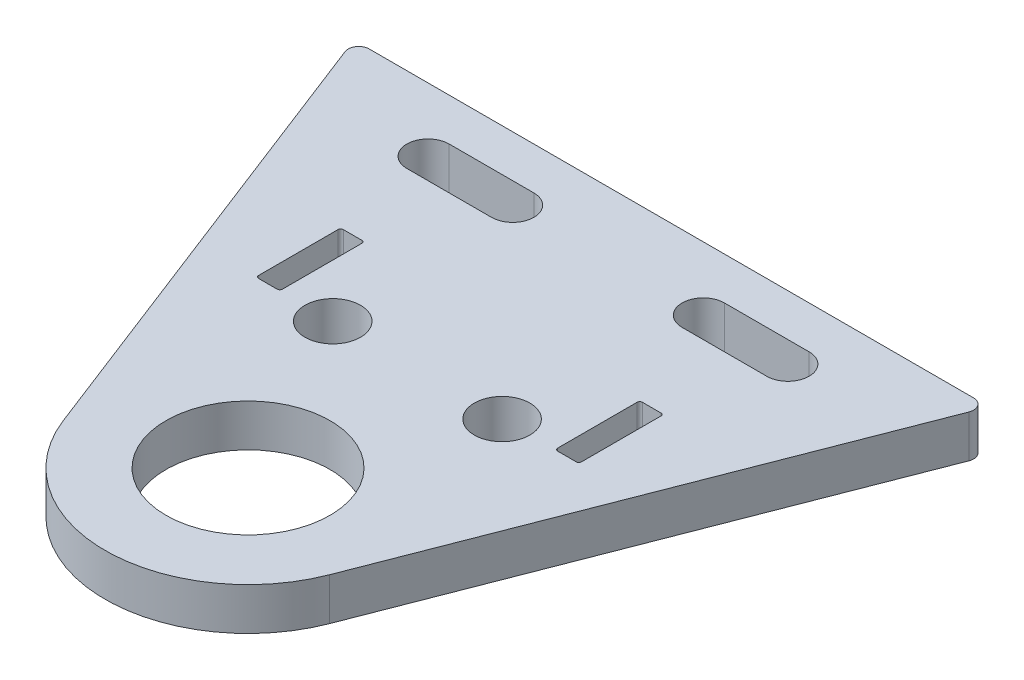
ISO-10303-21;
HEADER;
FILE_DESCRIPTION(('STEP AP214'),'2;1');
FILE_NAME('part.step','',(''),(''),'','','');
FILE_SCHEMA(('AUTOMOTIVE_DESIGN { 1 0 10303 214 1 1 1 1 }'));
ENDSEC;
DATA;
#1=APPLICATION_CONTEXT('core data for automotive mechanical design processes');
#2=APPLICATION_PROTOCOL_DEFINITION('international standard','automotive_design',2000,#1);
#3=PRODUCT_CONTEXT('',#1,'mechanical');
#4=PRODUCT('Part','Part','',(#3));
#5=PRODUCT_RELATED_PRODUCT_CATEGORY('part','',(#4));
#6=PRODUCT_DEFINITION_FORMATION('','',#4);
#7=PRODUCT_DEFINITION_CONTEXT('part definition',#1,'design');
#8=PRODUCT_DEFINITION('design','',#6,#7);
#9=PRODUCT_DEFINITION_SHAPE('','',#8);
#10=(LENGTH_UNIT() NAMED_UNIT(*) SI_UNIT(.MILLI.,.METRE.));
#11=(NAMED_UNIT(*) PLANE_ANGLE_UNIT() SI_UNIT($,.RADIAN.));
#12=(NAMED_UNIT(*) SI_UNIT($,.STERADIAN.) SOLID_ANGLE_UNIT());
#13=UNCERTAINTY_MEASURE_WITH_UNIT(LENGTH_MEASURE(1.E-05),#10,'distance_accuracy_value','');
#14=(GEOMETRIC_REPRESENTATION_CONTEXT(3) GLOBAL_UNCERTAINTY_ASSIGNED_CONTEXT((#13)) GLOBAL_UNIT_ASSIGNED_CONTEXT((#10,
#11,#12)) REPRESENTATION_CONTEXT('',''));
#15=CARTESIAN_POINT('',(0.,0.,0.));
#16=DIRECTION('',(0.,0.,1.));
#17=DIRECTION('',(1.,0.,0.));
#18=AXIS2_PLACEMENT_3D('',#15,#16,#17);
#19=CARTESIAN_POINT('',(-95.25,-12.7,0.));
#20=DIRECTION('',(-0.93228825773213,0.,0.361716193299098));
#21=DIRECTION('',(0.361716193299098,0.,0.93228825773213));
#22=AXIS2_PLACEMENT_3D('',#19,#20,#21);
#23=PLANE('',#22);
#24=DIRECTION('',(0.361716193299098,0.,0.93228825773213));
#25=VECTOR('',#24,1.);
#26=CARTESIAN_POINT('',(-95.25,0.,0.));
#27=LINE('',#26,#25);
#28=CARTESIAN_POINT('',(-93.5725558511272,0.,4.32344891372463));
#29=VERTEX_POINT('',#28);
#30=CARTESIAN_POINT('',(-39.9602054470433,0.,142.504060335283));
#31=VERTEX_POINT('',#30);
#32=EDGE_CURVE('E416',#29,#31,#27,.T.);
#33=ORIENTED_EDGE('',*,*,#32,.F.);
#34=DIRECTION('',(0.,1.,0.));
#35=VECTOR('',#34,1.);
#36=CARTESIAN_POINT('',(-93.5725558511272,-12.7,4.32344891372464));
#37=LINE('',#36,#35);
#38=CARTESIAN_POINT('',(-93.5725558511272,-12.7,4.32344891372463));
#39=VERTEX_POINT('',#38);
#40=EDGE_CURVE('E457',#29,#39,#37,.F.);
#41=ORIENTED_EDGE('',*,*,#40,.T.);
#42=DIRECTION('',(0.361716193299098,0.,0.93228825773213));
#43=VECTOR('',#42,1.);
#44=CARTESIAN_POINT('',(-95.25,-12.7,0.));
#45=LINE('',#44,#43);
#46=CARTESIAN_POINT('',(-39.9602054470433,-12.7,142.504060335283));
#47=VERTEX_POINT('',#46);
#48=EDGE_CURVE('E439',#39,#47,#45,.T.);
#49=ORIENTED_EDGE('',*,*,#48,.T.);
#50=DIRECTION('',(0.,1.,0.));
#51=VECTOR('',#50,1.);
#52=CARTESIAN_POINT('',(-39.9602054470433,-12.7,142.504060335283));
#53=LINE('',#52,#51);
#54=EDGE_CURVE('E443',#47,#31,#53,.T.);
#55=ORIENTED_EDGE('',*,*,#54,.T.);
#56=EDGE_LOOP('',(#33,#41,#49,#55));
#57=FACE_BOUND('',#56,.T.);
#58=ADVANCED_FACE('F56',(#57),#23,.T.);
#59=CARTESIAN_POINT('',(-95.25,-12.7,0.));
#60=DIRECTION('',(0.,0.,-1.));
#61=DIRECTION('',(-1.,0.,0.));
#62=AXIS2_PLACEMENT_3D('',#59,#60,#61);
#63=PLANE('',#62);
#64=DIRECTION('',(-1.,0.,0.));
#65=VECTOR('',#64,1.);
#66=CARTESIAN_POINT('',(-95.25,-12.7,0.));
#67=LINE('',#66,#65);
#68=CARTESIAN_POINT('',(90.6125406328277,-12.7,0.));
#69=VERTEX_POINT('',#68);
#70=CARTESIAN_POINT('',(-90.6125406328277,-12.7,0.));
#71=VERTEX_POINT('',#70);
#72=EDGE_CURVE('E446',#69,#71,#67,.T.);
#73=ORIENTED_EDGE('',*,*,#72,.T.);
#74=DIRECTION('',(0.,1.,0.));
#75=VECTOR('',#74,1.);
#76=CARTESIAN_POINT('',(-90.6125406328277,-12.7,0.));
#77=LINE('',#76,#75);
#78=CARTESIAN_POINT('',(-90.6125406328277,0.,0.));
#79=VERTEX_POINT('',#78);
#80=EDGE_CURVE('E448',#71,#79,#77,.T.);
#81=ORIENTED_EDGE('',*,*,#80,.T.);
#82=DIRECTION('',(-1.,0.,0.));
#83=VECTOR('',#82,1.);
#84=CARTESIAN_POINT('',(-95.25,0.,0.));
#85=LINE('',#84,#83);
#86=CARTESIAN_POINT('',(90.6125406328277,0.,0.));
#87=VERTEX_POINT('',#86);
#88=EDGE_CURVE('E435',#87,#79,#85,.T.);
#89=ORIENTED_EDGE('',*,*,#88,.F.);
#90=DIRECTION('',(0.,1.,0.));
#91=VECTOR('',#90,1.);
#92=CARTESIAN_POINT('',(90.6125406328277,-12.7,0.));
#93=LINE('',#92,#91);
#94=EDGE_CURVE('E442',#87,#69,#93,.F.);
#95=ORIENTED_EDGE('',*,*,#94,.T.);
#96=EDGE_LOOP('',(#73,#81,#89,#95));
#97=FACE_BOUND('',#96,.T.);
#98=ADVANCED_FACE('F677',(#97),#63,.T.);
#99=CARTESIAN_POINT('',(95.25,-12.7,0.));
#100=DIRECTION('',(0.93228825773213,0.,0.361716193299098));
#101=DIRECTION('',(0.361716193299098,0.,-0.93228825773213));
#102=AXIS2_PLACEMENT_3D('',#99,#100,#101);
#103=PLANE('',#102);
#104=DIRECTION('',(0.361716193299098,0.,-0.93228825773213));
#105=VECTOR('',#104,1.);
#106=CARTESIAN_POINT('',(95.25,-12.7,0.));
#107=LINE('',#106,#105);
#108=CARTESIAN_POINT('',(39.9602054470433,-12.7,142.504060335283));
#109=VERTEX_POINT('',#108);
#110=CARTESIAN_POINT('',(93.5725558511272,-12.7,4.32344891372463));
#111=VERTEX_POINT('',#110);
#112=EDGE_CURVE('E689',#109,#111,#107,.T.);
#113=ORIENTED_EDGE('',*,*,#112,.T.);
#114=DIRECTION('',(0.,1.,0.));
#115=VECTOR('',#114,1.);
#116=CARTESIAN_POINT('',(93.5725558511272,-12.7,4.32344891372463));
#117=LINE('',#116,#115);
#118=CARTESIAN_POINT('',(93.5725558511272,0.,4.32344891372463));
#119=VERTEX_POINT('',#118);
#120=EDGE_CURVE('E465',#111,#119,#117,.T.);
#121=ORIENTED_EDGE('',*,*,#120,.T.);
#122=DIRECTION('',(0.361716193299098,0.,-0.93228825773213));
#123=VECTOR('',#122,1.);
#124=CARTESIAN_POINT('',(95.25,0.,0.));
#125=LINE('',#124,#123);
#126=CARTESIAN_POINT('',(39.9602054470433,0.,142.504060335283));
#127=VERTEX_POINT('',#126);
#128=EDGE_CURVE('E429',#127,#119,#125,.T.);
#129=ORIENTED_EDGE('',*,*,#128,.F.);
#130=DIRECTION('',(0.,1.,0.));
#131=VECTOR('',#130,1.);
#132=CARTESIAN_POINT('',(39.9602054470433,-12.7,142.504060335283));
#133=LINE('',#132,#131);
#134=EDGE_CURVE('E440',#109,#127,#133,.T.);
#135=ORIENTED_EDGE('',*,*,#134,.F.);
#136=EDGE_LOOP('',(#113,#121,#129,#135));
#137=FACE_BOUND('',#136,.T.);
#138=ADVANCED_FACE('F692',(#137),#103,.T.);
#139=CARTESIAN_POINT('',(0.,-12.7,127.));
#140=DIRECTION('',(0.,1.,0.));
#141=DIRECTION('',(0.,0.,1.));
#142=AXIS2_PLACEMENT_3D('',#139,#140,#141);
#143=CYLINDRICAL_SURFACE('',#142,42.8624999999999);
#144=CARTESIAN_POINT('',(0.,0.,127.));
#145=DIRECTION('',(0.,1.,0.));
#146=DIRECTION('',(0.,0.,1.));
#147=AXIS2_PLACEMENT_3D('',#144,#145,#146);
#148=CIRCLE('',#147,42.8624999999999);
#149=EDGE_CURVE('E424',#31,#127,#148,.T.);
#150=ORIENTED_EDGE('',*,*,#149,.F.);
#151=ORIENTED_EDGE('',*,*,#54,.F.);
#152=CARTESIAN_POINT('',(0.,-12.7,127.));
#153=DIRECTION('',(0.,1.,0.));
#154=DIRECTION('',(0.,0.,1.));
#155=AXIS2_PLACEMENT_3D('',#152,#153,#154);
#156=CIRCLE('',#155,42.8624999999999);
#157=EDGE_CURVE('E695',#47,#109,#156,.T.);
#158=ORIENTED_EDGE('',*,*,#157,.T.);
#159=ORIENTED_EDGE('',*,*,#134,.T.);
#160=EDGE_LOOP('',(#150,#151,#158,#159));
#161=FACE_BOUND('',#160,.T.);
#162=ADVANCED_FACE('F745',(#161),#143,.T.);
#163=CARTESIAN_POINT('',(0.,-12.7,127.));
#164=DIRECTION('',(0.,1.,0.));
#165=DIRECTION('',(0.,0.,1.));
#166=AXIS2_PLACEMENT_3D('',#163,#164,#165);
#167=PLANE('',#166);
#168=DIRECTION('',(0.,0.,-1.));
#169=VECTOR('',#168,1.);
#170=CARTESIAN_POINT('',(48.41875,-12.7,76.2));
#171=LINE('',#170,#169);
#172=CARTESIAN_POINT('',(48.41875,-12.7,75.40625));
#173=VERTEX_POINT('',#172);
#174=CARTESIAN_POINT('',(48.41875,-12.7,51.59375));
#175=VERTEX_POINT('',#174);
#176=EDGE_CURVE('E572',#173,#175,#171,.T.);
#177=ORIENTED_EDGE('',*,*,#176,.T.);
#178=CARTESIAN_POINT('',(47.625,-12.7,51.59375));
#179=DIRECTION('',(0.,1.,0.));
#180=DIRECTION('',(0.,0.,1.));
#181=AXIS2_PLACEMENT_3D('',#178,#179,#180);
#182=CIRCLE('',#181,0.79375);
#183=CARTESIAN_POINT('',(47.625,-12.7,50.8));
#184=VERTEX_POINT('',#183);
#185=EDGE_CURVE('E12',#175,#184,#182,.T.);
#186=ORIENTED_EDGE('',*,*,#185,.T.);
#187=DIRECTION('',(-1.,0.,0.));
#188=VECTOR('',#187,1.);
#189=CARTESIAN_POINT('',(48.41875,-12.7,50.8));
#190=LINE('',#189,#188);
#191=CARTESIAN_POINT('',(42.06875,-12.7,50.8));
#192=VERTEX_POINT('',#191);
#193=EDGE_CURVE('E393',#184,#192,#190,.T.);
#194=ORIENTED_EDGE('',*,*,#193,.T.);
#195=CARTESIAN_POINT('',(42.06875,-12.7,51.59375));
#196=DIRECTION('',(0.,1.,0.));
#197=DIRECTION('',(0.,0.,1.));
#198=AXIS2_PLACEMENT_3D('',#195,#196,#197);
#199=CIRCLE('',#198,0.79375);
#200=CARTESIAN_POINT('',(41.275,-12.7,51.59375));
#201=VERTEX_POINT('',#200);
#202=EDGE_CURVE('E546',#192,#201,#199,.T.);
#203=ORIENTED_EDGE('',*,*,#202,.T.);
#204=DIRECTION('',(0.,0.,1.));
#205=VECTOR('',#204,1.);
#206=CARTESIAN_POINT('',(41.275,-12.7,76.2));
#207=LINE('',#206,#205);
#208=CARTESIAN_POINT('',(41.275,-12.7,75.40625));
#209=VERTEX_POINT('',#208);
#210=EDGE_CURVE('E588',#201,#209,#207,.T.);
#211=ORIENTED_EDGE('',*,*,#210,.T.);
#212=CARTESIAN_POINT('',(42.06875,-12.7,75.40625));
#213=DIRECTION('',(0.,1.,0.));
#214=DIRECTION('',(0.,0.,1.));
#215=AXIS2_PLACEMENT_3D('',#212,#213,#214);
#216=CIRCLE('',#215,0.79375);
#217=CARTESIAN_POINT('',(42.06875,-12.7,76.2));
#218=VERTEX_POINT('',#217);
#219=EDGE_CURVE('E540',#209,#218,#216,.T.);
#220=ORIENTED_EDGE('',*,*,#219,.T.);
#221=DIRECTION('',(1.,0.,0.));
#222=VECTOR('',#221,1.);
#223=CARTESIAN_POINT('',(48.41875,-12.7,76.2));
#224=LINE('',#223,#222);
#225=CARTESIAN_POINT('',(47.625,-12.7,76.2));
#226=VERTEX_POINT('',#225);
#227=EDGE_CURVE('E575',#218,#226,#224,.T.);
#228=ORIENTED_EDGE('',*,*,#227,.T.);
#229=CARTESIAN_POINT('',(47.625,-12.7,75.40625));
#230=DIRECTION('',(0.,1.,0.));
#231=DIRECTION('',(0.,0.,1.));
#232=AXIS2_PLACEMENT_3D('',#229,#230,#231);
#233=CIRCLE('',#232,0.79375);
#234=EDGE_CURVE('E534',#226,#173,#233,.T.);
#235=ORIENTED_EDGE('',*,*,#234,.T.);
#236=EDGE_LOOP('',(#177,#186,#194,#203,#211,#220,#228,#235));
#237=FACE_BOUND('',#236,.T.);
#238=DIRECTION('',(0.,0.,-1.));
#239=VECTOR('',#238,1.);
#240=CARTESIAN_POINT('',(-41.275,-12.7,76.2));
#241=LINE('',#240,#239);
#242=CARTESIAN_POINT('',(-41.275,-12.7,75.40625));
#243=VERTEX_POINT('',#242);
#244=CARTESIAN_POINT('',(-41.275,-12.7,51.59375));
#245=VERTEX_POINT('',#244);
#246=EDGE_CURVE('E596',#243,#245,#241,.T.);
#247=ORIENTED_EDGE('',*,*,#246,.T.);
#248=CARTESIAN_POINT('',(-42.06875,-12.7,51.59375));
#249=DIRECTION('',(0.,1.,0.));
#250=DIRECTION('',(0.,0.,1.));
#251=AXIS2_PLACEMENT_3D('',#248,#249,#250);
#252=CIRCLE('',#251,0.79375);
#253=CARTESIAN_POINT('',(-42.06875,-12.7,50.8));
#254=VERTEX_POINT('',#253);
#255=EDGE_CURVE('E516',#245,#254,#252,.T.);
#256=ORIENTED_EDGE('',*,*,#255,.T.);
#257=DIRECTION('',(-1.,0.,0.));
#258=VECTOR('',#257,1.);
#259=CARTESIAN_POINT('',(-41.275,-12.7,50.8));
#260=LINE('',#259,#258);
#261=CARTESIAN_POINT('',(-47.625,-12.7,50.8));
#262=VERTEX_POINT('',#261);
#263=EDGE_CURVE('E583',#254,#262,#260,.T.);
#264=ORIENTED_EDGE('',*,*,#263,.T.);
#265=CARTESIAN_POINT('',(-47.625,-12.7,51.59375));
#266=DIRECTION('',(0.,1.,0.));
#267=DIRECTION('',(0.,0.,1.));
#268=AXIS2_PLACEMENT_3D('',#265,#266,#267);
#269=CIRCLE('',#268,0.79375);
#270=CARTESIAN_POINT('',(-48.41875,-12.7,51.59375));
#271=VERTEX_POINT('',#270);
#272=EDGE_CURVE('E510',#262,#271,#269,.T.);
#273=ORIENTED_EDGE('',*,*,#272,.T.);
#274=DIRECTION('',(0.,0.,1.));
#275=VECTOR('',#274,1.);
#276=CARTESIAN_POINT('',(-48.41875,-12.7,76.2));
#277=LINE('',#276,#275);
#278=CARTESIAN_POINT('',(-48.41875,-12.7,75.40625));
#279=VERTEX_POINT('',#278);
#280=EDGE_CURVE('E589',#271,#279,#277,.T.);
#281=ORIENTED_EDGE('',*,*,#280,.T.);
#282=CARTESIAN_POINT('',(-47.625,-12.7,75.40625));
#283=DIRECTION('',(0.,1.,0.));
#284=DIRECTION('',(0.,0.,1.));
#285=AXIS2_PLACEMENT_3D('',#282,#283,#284);
#286=CIRCLE('',#285,0.79375);
#287=CARTESIAN_POINT('',(-47.625,-12.7,76.2));
#288=VERTEX_POINT('',#287);
#289=EDGE_CURVE('E522',#279,#288,#286,.T.);
#290=ORIENTED_EDGE('',*,*,#289,.T.);
#291=DIRECTION('',(1.,0.,0.));
#292=VECTOR('',#291,1.);
#293=CARTESIAN_POINT('',(-41.275,-12.7,76.2));
#294=LINE('',#293,#292);
#295=CARTESIAN_POINT('',(-42.06875,-12.7,76.2));
#296=VERTEX_POINT('',#295);
#297=EDGE_CURVE('E593',#288,#296,#294,.T.);
#298=ORIENTED_EDGE('',*,*,#297,.T.);
#299=CARTESIAN_POINT('',(-42.06875,-12.7,75.40625));
#300=DIRECTION('',(0.,1.,0.));
#301=DIRECTION('',(0.,0.,1.));
#302=AXIS2_PLACEMENT_3D('',#299,#300,#301);
#303=CIRCLE('',#302,0.79375);
#304=EDGE_CURVE('E528',#296,#243,#303,.T.);
#305=ORIENTED_EDGE('',*,*,#304,.T.);
#306=EDGE_LOOP('',(#247,#256,#264,#273,#281,#290,#298,#305));
#307=FACE_BOUND('',#306,.T.);
#308=DIRECTION('',(1.,0.,0.));
#309=VECTOR('',#308,1.);
#310=CARTESIAN_POINT('',(53.975,-12.7,25.3999999999999));
#311=LINE('',#310,#309);
#312=CARTESIAN_POINT('',(28.575,-12.7,25.3999999999999));
#313=VERTEX_POINT('',#312);
#314=CARTESIAN_POINT('',(53.975,-12.7,25.3999999999999));
#315=VERTEX_POINT('',#314);
#316=EDGE_CURVE('E326',#313,#315,#311,.T.);
#317=ORIENTED_EDGE('',*,*,#316,.T.);
#318=CARTESIAN_POINT('',(53.975,-12.7,19.0499999999999));
#319=DIRECTION('',(0.,1.,0.));
#320=DIRECTION('',(0.,0.,1.));
#321=AXIS2_PLACEMENT_3D('',#318,#319,#320);
#322=CIRCLE('',#321,6.35);
#323=CARTESIAN_POINT('',(53.975,-12.7,12.6999999999999));
#324=VERTEX_POINT('',#323);
#325=EDGE_CURVE('E318',#315,#324,#322,.T.);
#326=ORIENTED_EDGE('',*,*,#325,.T.);
#327=DIRECTION('',(-1.,0.,0.));
#328=VECTOR('',#327,1.);
#329=CARTESIAN_POINT('',(53.975,-12.7,12.6999999999999));
#330=LINE('',#329,#328);
#331=CARTESIAN_POINT('',(28.575,-12.7,12.6999999999999));
#332=VERTEX_POINT('',#331);
#333=EDGE_CURVE('E330',#324,#332,#330,.T.);
#334=ORIENTED_EDGE('',*,*,#333,.T.);
#335=CARTESIAN_POINT('',(28.575,-12.7,19.0499999999999));
#336=DIRECTION('',(0.,1.,0.));
#337=DIRECTION('',(0.,0.,1.));
#338=AXIS2_PLACEMENT_3D('',#335,#336,#337);
#339=CIRCLE('',#338,6.35);
#340=EDGE_CURVE('E335',#332,#313,#339,.T.);
#341=ORIENTED_EDGE('',*,*,#340,.T.);
#342=EDGE_LOOP('',(#317,#326,#334,#341));
#343=FACE_BOUND('',#342,.T.);
#344=DIRECTION('',(1.,0.,0.));
#345=VECTOR('',#344,1.);
#346=CARTESIAN_POINT('',(-28.575,-12.7,25.3999999999999));
#347=LINE('',#346,#345);
#348=CARTESIAN_POINT('',(-53.975,-12.7,25.3999999999999));
#349=VERTEX_POINT('',#348);
#350=CARTESIAN_POINT('',(-28.575,-12.7,25.3999999999999));
#351=VERTEX_POINT('',#350);
#352=EDGE_CURVE('E384',#349,#351,#347,.T.);
#353=ORIENTED_EDGE('',*,*,#352,.T.);
#354=CARTESIAN_POINT('',(-28.575,-12.7,19.0499999999999));
#355=DIRECTION('',(0.,1.,0.));
#356=DIRECTION('',(0.,0.,1.));
#357=AXIS2_PLACEMENT_3D('',#354,#355,#356);
#358=CIRCLE('',#357,6.35);
#359=CARTESIAN_POINT('',(-28.575,-12.7,12.6999999999999));
#360=VERTEX_POINT('',#359);
#361=EDGE_CURVE('E371',#351,#360,#358,.T.);
#362=ORIENTED_EDGE('',*,*,#361,.T.);
#363=DIRECTION('',(-1.,0.,0.));
#364=VECTOR('',#363,1.);
#365=CARTESIAN_POINT('',(-28.575,-12.7,12.6999999999999));
#366=LINE('',#365,#364);
#367=CARTESIAN_POINT('',(-53.975,-12.7,12.6999999999999));
#368=VERTEX_POINT('',#367);
#369=EDGE_CURVE('E375',#360,#368,#366,.T.);
#370=ORIENTED_EDGE('',*,*,#369,.T.);
#371=CARTESIAN_POINT('',(-53.975,-12.7,19.0499999999999));
#372=DIRECTION('',(0.,1.,0.));
#373=DIRECTION('',(0.,0.,1.));
#374=AXIS2_PLACEMENT_3D('',#371,#372,#373);
#375=CIRCLE('',#374,6.35);
#376=EDGE_CURVE('E380',#368,#349,#375,.T.);
#377=ORIENTED_EDGE('',*,*,#376,.T.);
#378=EDGE_LOOP('',(#353,#362,#370,#377));
#379=FACE_BOUND('',#378,.T.);
#380=CARTESIAN_POINT('',(0.,-12.7,127.));
#381=DIRECTION('',(0.,1.,0.));
#382=DIRECTION('',(0.,0.,1.));
#383=AXIS2_PLACEMENT_3D('',#380,#381,#382);
#384=CIRCLE('',#383,24.60625);
#385=CARTESIAN_POINT('',(0.,-12.7,151.60625));
#386=VERTEX_POINT('',#385);
#387=EDGE_CURVE('E411',#386,#386,#384,.T.);
#388=ORIENTED_EDGE('',*,*,#387,.T.);
#389=EDGE_LOOP('',(#388));
#390=FACE_BOUND('',#389,.T.);
#391=CARTESIAN_POINT('',(-25.4,-12.7,76.2));
#392=DIRECTION('',(0.,1.,0.));
#393=DIRECTION('',(0.,0.,1.));
#394=AXIS2_PLACEMENT_3D('',#391,#392,#393);
#395=CIRCLE('',#394,8.3312);
#396=CARTESIAN_POINT('',(-25.4,-12.7,84.5312));
#397=VERTEX_POINT('',#396);
#398=EDGE_CURVE('E711',#397,#397,#395,.T.);
#399=ORIENTED_EDGE('',*,*,#398,.T.);
#400=EDGE_LOOP('',(#399));
#401=FACE_BOUND('',#400,.T.);
#402=CARTESIAN_POINT('',(25.4,-12.7,76.2));
#403=DIRECTION('',(0.,1.,0.));
#404=DIRECTION('',(0.,0.,1.));
#405=AXIS2_PLACEMENT_3D('',#402,#403,#404);
#406=CIRCLE('',#405,8.33119999999999);
#407=CARTESIAN_POINT('',(25.4,-12.7,84.5312));
#408=VERTEX_POINT('',#407);
#409=EDGE_CURVE('E706',#408,#408,#406,.T.);
#410=ORIENTED_EDGE('',*,*,#409,.T.);
#411=EDGE_LOOP('',(#410));
#412=FACE_BOUND('',#411,.T.);
#413=ORIENTED_EDGE('',*,*,#48,.F.);
#414=CARTESIAN_POINT('',(-90.6125406328277,-12.7,3.175));
#415=DIRECTION('',(0.,1.,0.));
#416=DIRECTION('',(0.,0.,1.));
#417=AXIS2_PLACEMENT_3D('',#414,#415,#416);
#418=CIRCLE('',#417,3.175);
#419=EDGE_CURVE('E462',#39,#71,#418,.F.);
#420=ORIENTED_EDGE('',*,*,#419,.T.);
#421=ORIENTED_EDGE('',*,*,#72,.F.);
#422=CARTESIAN_POINT('',(90.6125406328277,-12.7,3.175));
#423=DIRECTION('',(0.,1.,0.));
#424=DIRECTION('',(0.,0.,1.));
#425=AXIS2_PLACEMENT_3D('',#422,#423,#424);
#426=CIRCLE('',#425,3.175);
#427=EDGE_CURVE('E459',#69,#111,#426,.F.);
#428=ORIENTED_EDGE('',*,*,#427,.T.);
#429=ORIENTED_EDGE('',*,*,#112,.F.);
#430=ORIENTED_EDGE('',*,*,#157,.F.);
#431=EDGE_LOOP('',(#413,#420,#421,#428,#429,#430));
#432=FACE_BOUND('',#431,.T.);
#433=ADVANCED_FACE('F337',(#237,#307,#343,#379,#390,#401,#412,#432),#167,.F.);
#434=CARTESIAN_POINT('',(0.,0.,127.));
#435=DIRECTION('',(0.,1.,0.));
#436=DIRECTION('',(0.,0.,1.));
#437=AXIS2_PLACEMENT_3D('',#434,#435,#436);
#438=PLANE('',#437);
#439=DIRECTION('',(0.,0.,1.));
#440=VECTOR('',#439,1.);
#441=CARTESIAN_POINT('',(41.275,0.,76.2));
#442=LINE('',#441,#440);
#443=CARTESIAN_POINT('',(41.275,0.,51.59375));
#444=VERTEX_POINT('',#443);
#445=CARTESIAN_POINT('',(41.275,0.,75.40625));
#446=VERTEX_POINT('',#445);
#447=EDGE_CURVE('E579',#444,#446,#442,.T.);
#448=ORIENTED_EDGE('',*,*,#447,.F.);
#449=CARTESIAN_POINT('',(42.06875,0.,51.59375));
#450=DIRECTION('',(0.,1.,0.));
#451=DIRECTION('',(0.,0.,1.));
#452=AXIS2_PLACEMENT_3D('',#449,#450,#451);
#453=CIRCLE('',#452,0.79375);
#454=CARTESIAN_POINT('',(42.06875,0.,50.8));
#455=VERTEX_POINT('',#454);
#456=EDGE_CURVE('E543',#444,#455,#453,.F.);
#457=ORIENTED_EDGE('',*,*,#456,.T.);
#458=DIRECTION('',(-1.,0.,0.));
#459=VECTOR('',#458,1.);
#460=CARTESIAN_POINT('',(48.41875,0.,50.8));
#461=LINE('',#460,#459);
#462=CARTESIAN_POINT('',(47.625,0.,50.8));
#463=VERTEX_POINT('',#462);
#464=EDGE_CURVE('E558',#463,#455,#461,.T.);
#465=ORIENTED_EDGE('',*,*,#464,.F.);
#466=CARTESIAN_POINT('',(47.625,0.,51.59375));
#467=DIRECTION('',(0.,1.,0.));
#468=DIRECTION('',(0.,0.,1.));
#469=AXIS2_PLACEMENT_3D('',#466,#467,#468);
#470=CIRCLE('',#469,0.79375);
#471=CARTESIAN_POINT('',(48.41875,0.,51.59375));
#472=VERTEX_POINT('',#471);
#473=EDGE_CURVE('E65',#463,#472,#470,.F.);
#474=ORIENTED_EDGE('',*,*,#473,.T.);
#475=DIRECTION('',(0.,0.,-1.));
#476=VECTOR('',#475,1.);
#477=CARTESIAN_POINT('',(48.41875,0.,76.2));
#478=LINE('',#477,#476);
#479=CARTESIAN_POINT('',(48.41875,0.,75.40625));
#480=VERTEX_POINT('',#479);
#481=EDGE_CURVE('E557',#480,#472,#478,.T.);
#482=ORIENTED_EDGE('',*,*,#481,.F.);
#483=CARTESIAN_POINT('',(47.625,0.,75.40625));
#484=DIRECTION('',(0.,1.,0.));
#485=DIRECTION('',(0.,0.,1.));
#486=AXIS2_PLACEMENT_3D('',#483,#484,#485);
#487=CIRCLE('',#486,0.79375);
#488=CARTESIAN_POINT('',(47.625,0.,76.2));
#489=VERTEX_POINT('',#488);
#490=EDGE_CURVE('E531',#480,#489,#487,.F.);
#491=ORIENTED_EDGE('',*,*,#490,.T.);
#492=DIRECTION('',(1.,0.,0.));
#493=VECTOR('',#492,1.);
#494=CARTESIAN_POINT('',(48.41875,0.,76.2));
#495=LINE('',#494,#493);
#496=CARTESIAN_POINT('',(42.06875,0.,76.2));
#497=VERTEX_POINT('',#496);
#498=EDGE_CURVE('E567',#497,#489,#495,.T.);
#499=ORIENTED_EDGE('',*,*,#498,.F.);
#500=CARTESIAN_POINT('',(42.06875,0.,75.40625));
#501=DIRECTION('',(0.,1.,0.));
#502=DIRECTION('',(0.,0.,1.));
#503=AXIS2_PLACEMENT_3D('',#500,#501,#502);
#504=CIRCLE('',#503,0.79375);
#505=EDGE_CURVE('E537',#497,#446,#504,.F.);
#506=ORIENTED_EDGE('',*,*,#505,.T.);
#507=EDGE_LOOP('',(#448,#457,#465,#474,#482,#491,#499,#506));
#508=FACE_BOUND('',#507,.T.);
#509=DIRECTION('',(0.,0.,1.));
#510=VECTOR('',#509,1.);
#511=CARTESIAN_POINT('',(-48.41875,0.,76.2));
#512=LINE('',#511,#510);
#513=CARTESIAN_POINT('',(-48.41875,0.,51.59375));
#514=VERTEX_POINT('',#513);
#515=CARTESIAN_POINT('',(-48.41875,0.,75.40625));
#516=VERTEX_POINT('',#515);
#517=EDGE_CURVE('E603',#514,#516,#512,.T.);
#518=ORIENTED_EDGE('',*,*,#517,.F.);
#519=CARTESIAN_POINT('',(-47.625,0.,51.59375));
#520=DIRECTION('',(0.,1.,0.));
#521=DIRECTION('',(0.,0.,1.));
#522=AXIS2_PLACEMENT_3D('',#519,#520,#521);
#523=CIRCLE('',#522,0.79375);
#524=CARTESIAN_POINT('',(-47.625,0.,50.8));
#525=VERTEX_POINT('',#524);
#526=EDGE_CURVE('E507',#514,#525,#523,.F.);
#527=ORIENTED_EDGE('',*,*,#526,.T.);
#528=DIRECTION('',(-1.,0.,0.));
#529=VECTOR('',#528,1.);
#530=CARTESIAN_POINT('',(-41.275,0.,50.8));
#531=LINE('',#530,#529);
#532=CARTESIAN_POINT('',(-42.06875,0.,50.8));
#533=VERTEX_POINT('',#532);
#534=EDGE_CURVE('E350',#533,#525,#531,.T.);
#535=ORIENTED_EDGE('',*,*,#534,.F.);
#536=CARTESIAN_POINT('',(-42.06875,0.,51.59375));
#537=DIRECTION('',(0.,1.,0.));
#538=DIRECTION('',(0.,0.,1.));
#539=AXIS2_PLACEMENT_3D('',#536,#537,#538);
#540=CIRCLE('',#539,0.79375);
#541=CARTESIAN_POINT('',(-41.275,0.,51.59375));
#542=VERTEX_POINT('',#541);
#543=EDGE_CURVE('E513',#533,#542,#540,.F.);
#544=ORIENTED_EDGE('',*,*,#543,.T.);
#545=DIRECTION('',(0.,0.,-1.));
#546=VECTOR('',#545,1.);
#547=CARTESIAN_POINT('',(-41.275,0.,76.2));
#548=LINE('',#547,#546);
#549=CARTESIAN_POINT('',(-41.275,0.,75.40625));
#550=VERTEX_POINT('',#549);
#551=EDGE_CURVE('E610',#550,#542,#548,.T.);
#552=ORIENTED_EDGE('',*,*,#551,.F.);
#553=CARTESIAN_POINT('',(-42.06875,0.,75.40625));
#554=DIRECTION('',(0.,1.,0.));
#555=DIRECTION('',(0.,0.,1.));
#556=AXIS2_PLACEMENT_3D('',#553,#554,#555);
#557=CIRCLE('',#556,0.79375);
#558=CARTESIAN_POINT('',(-42.06875,0.,76.2));
#559=VERTEX_POINT('',#558);
#560=EDGE_CURVE('E525',#550,#559,#557,.F.);
#561=ORIENTED_EDGE('',*,*,#560,.T.);
#562=DIRECTION('',(1.,0.,0.));
#563=VECTOR('',#562,1.);
#564=CARTESIAN_POINT('',(-41.275,0.,76.2));
#565=LINE('',#564,#563);
#566=CARTESIAN_POINT('',(-47.625,0.,76.2));
#567=VERTEX_POINT('',#566);
#568=EDGE_CURVE('E607',#567,#559,#565,.T.);
#569=ORIENTED_EDGE('',*,*,#568,.F.);
#570=CARTESIAN_POINT('',(-47.625,0.,75.40625));
#571=DIRECTION('',(0.,1.,0.));
#572=DIRECTION('',(0.,0.,1.));
#573=AXIS2_PLACEMENT_3D('',#570,#571,#572);
#574=CIRCLE('',#573,0.79375);
#575=EDGE_CURVE('E519',#567,#516,#574,.F.);
#576=ORIENTED_EDGE('',*,*,#575,.T.);
#577=EDGE_LOOP('',(#518,#527,#535,#544,#552,#561,#569,#576));
#578=FACE_BOUND('',#577,.T.);
#579=CARTESIAN_POINT('',(53.975,0.,19.0499999999999));
#580=DIRECTION('',(0.,1.,0.));
#581=DIRECTION('',(0.,0.,1.));
#582=AXIS2_PLACEMENT_3D('',#579,#580,#581);
#583=CIRCLE('',#582,6.35);
#584=CARTESIAN_POINT('',(53.975,0.,25.3999999999999));
#585=VERTEX_POINT('',#584);
#586=CARTESIAN_POINT('',(53.975,0.,12.6999999999999));
#587=VERTEX_POINT('',#586);
#588=EDGE_CURVE('E321',#585,#587,#583,.T.);
#589=ORIENTED_EDGE('',*,*,#588,.F.);
#590=DIRECTION('',(1.,0.,0.));
#591=VECTOR('',#590,1.);
#592=CARTESIAN_POINT('',(53.975,0.,25.3999999999999));
#593=LINE('',#592,#591);
#594=CARTESIAN_POINT('',(28.575,0.,25.3999999999999));
#595=VERTEX_POINT('',#594);
#596=EDGE_CURVE('E341',#595,#585,#593,.T.);
#597=ORIENTED_EDGE('',*,*,#596,.F.);
#598=CARTESIAN_POINT('',(28.575,0.,19.0499999999999));
#599=DIRECTION('',(0.,1.,0.));
#600=DIRECTION('',(0.,0.,1.));
#601=AXIS2_PLACEMENT_3D('',#598,#599,#600);
#602=CIRCLE('',#601,6.35);
#603=CARTESIAN_POINT('',(28.575,0.,12.6999999999999));
#604=VERTEX_POINT('',#603);
#605=EDGE_CURVE('E347',#604,#595,#602,.T.);
#606=ORIENTED_EDGE('',*,*,#605,.F.);
#607=DIRECTION('',(-1.,0.,0.));
#608=VECTOR('',#607,1.);
#609=CARTESIAN_POINT('',(53.975,0.,12.6999999999999));
#610=LINE('',#609,#608);
#611=EDGE_CURVE('E358',#587,#604,#610,.T.);
#612=ORIENTED_EDGE('',*,*,#611,.F.);
#613=EDGE_LOOP('',(#589,#597,#606,#612));
#614=FACE_BOUND('',#613,.T.);
#615=CARTESIAN_POINT('',(-28.575,0.,19.0499999999999));
#616=DIRECTION('',(0.,1.,0.));
#617=DIRECTION('',(0.,0.,1.));
#618=AXIS2_PLACEMENT_3D('',#615,#616,#617);
#619=CIRCLE('',#618,6.35);
#620=CARTESIAN_POINT('',(-28.575,0.,25.3999999999999));
#621=VERTEX_POINT('',#620);
#622=CARTESIAN_POINT('',(-28.575,0.,12.6999999999999));
#623=VERTEX_POINT('',#622);
#624=EDGE_CURVE('E389',#621,#623,#619,.T.);
#625=ORIENTED_EDGE('',*,*,#624,.F.);
#626=DIRECTION('',(1.,0.,0.));
#627=VECTOR('',#626,1.);
#628=CARTESIAN_POINT('',(-28.575,0.,25.3999999999999));
#629=LINE('',#628,#627);
#630=CARTESIAN_POINT('',(-53.975,0.,25.3999999999999));
#631=VERTEX_POINT('',#630);
#632=EDGE_CURVE('E376',#631,#621,#629,.T.);
#633=ORIENTED_EDGE('',*,*,#632,.F.);
#634=CARTESIAN_POINT('',(-53.975,0.,19.0499999999999));
#635=DIRECTION('',(0.,1.,0.));
#636=DIRECTION('',(0.,0.,1.));
#637=AXIS2_PLACEMENT_3D('',#634,#635,#636);
#638=CIRCLE('',#637,6.35);
#639=CARTESIAN_POINT('',(-53.975,0.,12.7));
#640=VERTEX_POINT('',#639);
#641=EDGE_CURVE('E397',#640,#631,#638,.T.);
#642=ORIENTED_EDGE('',*,*,#641,.F.);
#643=DIRECTION('',(-1.,0.,0.));
#644=VECTOR('',#643,1.);
#645=CARTESIAN_POINT('',(-28.575,0.,12.6999999999999));
#646=LINE('',#645,#644);
#647=EDGE_CURVE('E392',#623,#640,#646,.T.);
#648=ORIENTED_EDGE('',*,*,#647,.F.);
#649=EDGE_LOOP('',(#625,#633,#642,#648));
#650=FACE_BOUND('',#649,.T.);
#651=CARTESIAN_POINT('',(0.,0.,127.));
#652=DIRECTION('',(0.,1.,0.));
#653=DIRECTION('',(0.,0.,1.));
#654=AXIS2_PLACEMENT_3D('',#651,#652,#653);
#655=CIRCLE('',#654,24.60625);
#656=CARTESIAN_POINT('',(0.,0.,151.60625));
#657=VERTEX_POINT('',#656);
#658=EDGE_CURVE('E417',#657,#657,#655,.T.);
#659=ORIENTED_EDGE('',*,*,#658,.F.);
#660=EDGE_LOOP('',(#659));
#661=FACE_BOUND('',#660,.T.);
#662=CARTESIAN_POINT('',(-25.4,0.,76.2));
#663=DIRECTION('',(0.,1.,0.));
#664=DIRECTION('',(0.,0.,1.));
#665=AXIS2_PLACEMENT_3D('',#662,#663,#664);
#666=CIRCLE('',#665,8.3312);
#667=CARTESIAN_POINT('',(-25.4,0.,84.5312));
#668=VERTEX_POINT('',#667);
#669=EDGE_CURVE('E668',#668,#668,#666,.T.);
#670=ORIENTED_EDGE('',*,*,#669,.F.);
#671=EDGE_LOOP('',(#670));
#672=FACE_BOUND('',#671,.T.);
#673=CARTESIAN_POINT('',(25.4,0.,76.2));
#674=DIRECTION('',(0.,1.,0.));
#675=DIRECTION('',(0.,0.,1.));
#676=AXIS2_PLACEMENT_3D('',#673,#674,#675);
#677=CIRCLE('',#676,8.33119999999999);
#678=CARTESIAN_POINT('',(25.4,0.,84.5312));
#679=VERTEX_POINT('',#678);
#680=EDGE_CURVE('E367',#679,#679,#677,.T.);
#681=ORIENTED_EDGE('',*,*,#680,.F.);
#682=EDGE_LOOP('',(#681));
#683=FACE_BOUND('',#682,.T.);
#684=ORIENTED_EDGE('',*,*,#88,.T.);
#685=CARTESIAN_POINT('',(-90.6125406328277,0.,3.175));
#686=DIRECTION('',(0.,1.,0.));
#687=DIRECTION('',(0.,0.,1.));
#688=AXIS2_PLACEMENT_3D('',#685,#686,#687);
#689=CIRCLE('',#688,3.175);
#690=EDGE_CURVE('E454',#79,#29,#689,.T.);
#691=ORIENTED_EDGE('',*,*,#690,.T.);
#692=ORIENTED_EDGE('',*,*,#32,.T.);
#693=ORIENTED_EDGE('',*,*,#149,.T.);
#694=ORIENTED_EDGE('',*,*,#128,.T.);
#695=CARTESIAN_POINT('',(90.6125406328277,0.,3.175));
#696=DIRECTION('',(0.,1.,0.));
#697=DIRECTION('',(0.,0.,1.));
#698=AXIS2_PLACEMENT_3D('',#695,#696,#697);
#699=CIRCLE('',#698,3.175);
#700=EDGE_CURVE('E451',#119,#87,#699,.T.);
#701=ORIENTED_EDGE('',*,*,#700,.T.);
#702=EDGE_LOOP('',(#684,#691,#692,#693,#694,#701));
#703=FACE_BOUND('',#702,.T.);
#704=ADVANCED_FACE('F555',(#508,#578,#614,#650,#661,#672,#683,#703),#438,.T.);
#705=CARTESIAN_POINT('',(25.4,-12.7,76.2));
#706=DIRECTION('',(0.,1.,0.));
#707=DIRECTION('',(0.,0.,1.));
#708=AXIS2_PLACEMENT_3D('',#705,#706,#707);
#709=CYLINDRICAL_SURFACE('',#708,8.33119999999999);
#710=ORIENTED_EDGE('',*,*,#409,.F.);
#711=EDGE_LOOP('',(#710));
#712=FACE_BOUND('',#711,.T.);
#713=ORIENTED_EDGE('',*,*,#680,.T.);
#714=EDGE_LOOP('',(#713));
#715=FACE_BOUND('',#714,.T.);
#716=ADVANCED_FACE('F654',(#712,#715),#709,.F.);
#717=CARTESIAN_POINT('',(-25.4,-12.7,76.2));
#718=DIRECTION('',(0.,1.,0.));
#719=DIRECTION('',(0.,0.,1.));
#720=AXIS2_PLACEMENT_3D('',#717,#718,#719);
#721=CYLINDRICAL_SURFACE('',#720,8.3312);
#722=ORIENTED_EDGE('',*,*,#398,.F.);
#723=EDGE_LOOP('',(#722));
#724=FACE_BOUND('',#723,.T.);
#725=ORIENTED_EDGE('',*,*,#669,.T.);
#726=EDGE_LOOP('',(#725));
#727=FACE_BOUND('',#726,.T.);
#728=ADVANCED_FACE('F721',(#724,#727),#721,.F.);
#729=CARTESIAN_POINT('',(0.,-12.7,127.));
#730=DIRECTION('',(0.,1.,0.));
#731=DIRECTION('',(0.,0.,1.));
#732=AXIS2_PLACEMENT_3D('',#729,#730,#731);
#733=CYLINDRICAL_SURFACE('',#732,24.60625);
#734=ORIENTED_EDGE('',*,*,#387,.F.);
#735=EDGE_LOOP('',(#734));
#736=FACE_BOUND('',#735,.T.);
#737=ORIENTED_EDGE('',*,*,#658,.T.);
#738=EDGE_LOOP('',(#737));
#739=FACE_BOUND('',#738,.T.);
#740=ADVANCED_FACE('F718',(#736,#739),#733,.F.);
#741=CARTESIAN_POINT('',(-28.575,-12.7,19.0499999999999));
#742=DIRECTION('',(0.,1.,0.));
#743=DIRECTION('',(0.,0.,1.));
#744=AXIS2_PLACEMENT_3D('',#741,#742,#743);
#745=CYLINDRICAL_SURFACE('',#744,6.35);
#746=ORIENTED_EDGE('',*,*,#624,.T.);
#747=DIRECTION('',(0.,1.,0.));
#748=VECTOR('',#747,1.);
#749=CARTESIAN_POINT('',(-28.575,-12.7,12.6999999999999));
#750=LINE('',#749,#748);
#751=EDGE_CURVE('E388',#360,#623,#750,.T.);
#752=ORIENTED_EDGE('',*,*,#751,.F.);
#753=ORIENTED_EDGE('',*,*,#361,.F.);
#754=DIRECTION('',(0.,1.,0.));
#755=VECTOR('',#754,1.);
#756=CARTESIAN_POINT('',(-28.575,-12.7,25.3999999999999));
#757=LINE('',#756,#755);
#758=EDGE_CURVE('E359',#351,#621,#757,.T.);
#759=ORIENTED_EDGE('',*,*,#758,.T.);
#760=EDGE_LOOP('',(#746,#752,#753,#759));
#761=FACE_BOUND('',#760,.T.);
#762=ADVANCED_FACE('F720',(#761),#745,.F.);
#763=CARTESIAN_POINT('',(-28.575,-12.7,25.3999999999999));
#764=DIRECTION('',(0.,0.,1.));
#765=DIRECTION('',(1.,0.,0.));
#766=AXIS2_PLACEMENT_3D('',#763,#764,#765);
#767=PLANE('',#766);
#768=ORIENTED_EDGE('',*,*,#632,.T.);
#769=ORIENTED_EDGE('',*,*,#758,.F.);
#770=ORIENTED_EDGE('',*,*,#352,.F.);
#771=DIRECTION('',(0.,1.,0.));
#772=VECTOR('',#771,1.);
#773=CARTESIAN_POINT('',(-53.975,-12.7,25.3999999999999));
#774=LINE('',#773,#772);
#775=EDGE_CURVE('E405',#349,#631,#774,.T.);
#776=ORIENTED_EDGE('',*,*,#775,.T.);
#777=EDGE_LOOP('',(#768,#769,#770,#776));
#778=FACE_BOUND('',#777,.T.);
#779=ADVANCED_FACE('F728',(#778),#767,.F.);
#780=CARTESIAN_POINT('',(-53.975,-12.7,19.0499999999999));
#781=DIRECTION('',(0.,1.,0.));
#782=DIRECTION('',(0.,0.,1.));
#783=AXIS2_PLACEMENT_3D('',#780,#781,#782);
#784=CYLINDRICAL_SURFACE('',#783,6.35);
#785=ORIENTED_EDGE('',*,*,#641,.T.);
#786=ORIENTED_EDGE('',*,*,#775,.F.);
#787=ORIENTED_EDGE('',*,*,#376,.F.);
#788=DIRECTION('',(0.,1.,0.));
#789=VECTOR('',#788,1.);
#790=CARTESIAN_POINT('',(-53.975,-12.7,12.7));
#791=LINE('',#790,#789);
#792=EDGE_CURVE('E407',#368,#640,#791,.T.);
#793=ORIENTED_EDGE('',*,*,#792,.T.);
#794=EDGE_LOOP('',(#785,#786,#787,#793));
#795=FACE_BOUND('',#794,.T.);
#796=ADVANCED_FACE('F822',(#795),#784,.F.);
#797=CARTESIAN_POINT('',(-28.575,-12.7,12.6999999999999));
#798=DIRECTION('',(0.,0.,-1.));
#799=DIRECTION('',(-1.,0.,0.));
#800=AXIS2_PLACEMENT_3D('',#797,#798,#799);
#801=PLANE('',#800);
#802=ORIENTED_EDGE('',*,*,#647,.T.);
#803=ORIENTED_EDGE('',*,*,#792,.F.);
#804=ORIENTED_EDGE('',*,*,#369,.F.);
#805=ORIENTED_EDGE('',*,*,#751,.T.);
#806=EDGE_LOOP('',(#802,#803,#804,#805));
#807=FACE_BOUND('',#806,.T.);
#808=ADVANCED_FACE('F819',(#807),#801,.F.);
#809=CARTESIAN_POINT('',(53.975,-12.7,19.0499999999999));
#810=DIRECTION('',(0.,1.,0.));
#811=DIRECTION('',(0.,0.,1.));
#812=AXIS2_PLACEMENT_3D('',#809,#810,#811);
#813=CYLINDRICAL_SURFACE('',#812,6.35);
#814=ORIENTED_EDGE('',*,*,#588,.T.);
#815=DIRECTION('',(0.,1.,0.));
#816=VECTOR('',#815,1.);
#817=CARTESIAN_POINT('',(53.975,-12.7,12.6999999999999));
#818=LINE('',#817,#816);
#819=EDGE_CURVE('E314',#324,#587,#818,.T.);
#820=ORIENTED_EDGE('',*,*,#819,.F.);
#821=ORIENTED_EDGE('',*,*,#325,.F.);
#822=DIRECTION('',(0.,1.,0.));
#823=VECTOR('',#822,1.);
#824=CARTESIAN_POINT('',(53.975,-12.7,25.3999999999999));
#825=LINE('',#824,#823);
#826=EDGE_CURVE('E365',#315,#585,#825,.T.);
#827=ORIENTED_EDGE('',*,*,#826,.T.);
#828=EDGE_LOOP('',(#814,#820,#821,#827));
#829=FACE_BOUND('',#828,.T.);
#830=ADVANCED_FACE('F316',(#829),#813,.F.);
#831=CARTESIAN_POINT('',(53.975,-12.7,25.3999999999999));
#832=DIRECTION('',(0.,0.,1.));
#833=DIRECTION('',(1.,0.,0.));
#834=AXIS2_PLACEMENT_3D('',#831,#832,#833);
#835=PLANE('',#834);
#836=ORIENTED_EDGE('',*,*,#596,.T.);
#837=ORIENTED_EDGE('',*,*,#826,.F.);
#838=ORIENTED_EDGE('',*,*,#316,.F.);
#839=DIRECTION('',(0.,1.,0.));
#840=VECTOR('',#839,1.);
#841=CARTESIAN_POINT('',(28.575,-12.7,25.3999999999999));
#842=LINE('',#841,#840);
#843=EDGE_CURVE('E368',#313,#595,#842,.T.);
#844=ORIENTED_EDGE('',*,*,#843,.T.);
#845=EDGE_LOOP('',(#836,#837,#838,#844));
#846=FACE_BOUND('',#845,.T.);
#847=ADVANCED_FACE('F807',(#846),#835,.F.);
#848=CARTESIAN_POINT('',(28.575,-12.7,19.0499999999999));
#849=DIRECTION('',(0.,1.,0.));
#850=DIRECTION('',(0.,0.,1.));
#851=AXIS2_PLACEMENT_3D('',#848,#849,#850);
#852=CYLINDRICAL_SURFACE('',#851,6.35);
#853=ORIENTED_EDGE('',*,*,#605,.T.);
#854=ORIENTED_EDGE('',*,*,#843,.F.);
#855=ORIENTED_EDGE('',*,*,#340,.F.);
#856=DIRECTION('',(0.,1.,0.));
#857=VECTOR('',#856,1.);
#858=CARTESIAN_POINT('',(28.575,-12.7,12.6999999999999));
#859=LINE('',#858,#857);
#860=EDGE_CURVE('E325',#332,#604,#859,.T.);
#861=ORIENTED_EDGE('',*,*,#860,.T.);
#862=EDGE_LOOP('',(#853,#854,#855,#861));
#863=FACE_BOUND('',#862,.T.);
#864=ADVANCED_FACE('F810',(#863),#852,.F.);
#865=CARTESIAN_POINT('',(53.975,-12.7,12.6999999999999));
#866=DIRECTION('',(0.,0.,-1.));
#867=DIRECTION('',(-1.,0.,0.));
#868=AXIS2_PLACEMENT_3D('',#865,#866,#867);
#869=PLANE('',#868);
#870=ORIENTED_EDGE('',*,*,#611,.T.);
#871=ORIENTED_EDGE('',*,*,#860,.F.);
#872=ORIENTED_EDGE('',*,*,#333,.F.);
#873=ORIENTED_EDGE('',*,*,#819,.T.);
#874=EDGE_LOOP('',(#870,#871,#872,#873));
#875=FACE_BOUND('',#874,.T.);
#876=ADVANCED_FACE('F331',(#875),#869,.F.);
#877=CARTESIAN_POINT('',(-90.6125406328277,-12.7,3.175));
#878=DIRECTION('',(0.,1.,0.));
#879=DIRECTION('',(0.,0.,1.));
#880=AXIS2_PLACEMENT_3D('',#877,#878,#879);
#881=CYLINDRICAL_SURFACE('',#880,3.175);
#882=ORIENTED_EDGE('',*,*,#419,.F.);
#883=ORIENTED_EDGE('',*,*,#40,.F.);
#884=ORIENTED_EDGE('',*,*,#690,.F.);
#885=ORIENTED_EDGE('',*,*,#80,.F.);
#886=EDGE_LOOP('',(#882,#883,#884,#885));
#887=FACE_BOUND('',#886,.T.);
#888=ADVANCED_FACE('F747',(#887),#881,.T.);
#889=CARTESIAN_POINT('',(90.6125406328277,-12.7,3.175));
#890=DIRECTION('',(0.,1.,0.));
#891=DIRECTION('',(0.,0.,1.));
#892=AXIS2_PLACEMENT_3D('',#889,#890,#891);
#893=CYLINDRICAL_SURFACE('',#892,3.175);
#894=ORIENTED_EDGE('',*,*,#427,.F.);
#895=ORIENTED_EDGE('',*,*,#94,.F.);
#896=ORIENTED_EDGE('',*,*,#700,.F.);
#897=ORIENTED_EDGE('',*,*,#120,.F.);
#898=EDGE_LOOP('',(#894,#895,#896,#897));
#899=FACE_BOUND('',#898,.T.);
#900=ADVANCED_FACE('F682',(#899),#893,.T.);
#901=CARTESIAN_POINT('',(-48.41875,-12.7,76.2));
#902=DIRECTION('',(-1.,0.,0.));
#903=DIRECTION('',(0.,0.,1.));
#904=AXIS2_PLACEMENT_3D('',#901,#902,#903);
#905=PLANE('',#904);
#906=ORIENTED_EDGE('',*,*,#280,.F.);
#907=DIRECTION('',(0.,1.,0.));
#908=VECTOR('',#907,1.);
#909=CARTESIAN_POINT('',(-48.41875,0.,51.59375));
#910=LINE('',#909,#908);
#911=EDGE_CURVE('E470',#271,#514,#910,.T.);
#912=ORIENTED_EDGE('',*,*,#911,.T.);
#913=ORIENTED_EDGE('',*,*,#517,.T.);
#914=DIRECTION('',(0.,1.,0.));
#915=VECTOR('',#914,1.);
#916=CARTESIAN_POINT('',(-48.41875,-12.7,75.40625));
#917=LINE('',#916,#915);
#918=EDGE_CURVE('E468',#516,#279,#917,.F.);
#919=ORIENTED_EDGE('',*,*,#918,.T.);
#920=EDGE_LOOP('',(#906,#912,#913,#919));
#921=FACE_BOUND('',#920,.T.);
#922=ADVANCED_FACE('F632',(#921),#905,.F.);
#923=CARTESIAN_POINT('',(-41.275,-12.7,50.8));
#924=DIRECTION('',(0.,0.,-1.));
#925=DIRECTION('',(-1.,0.,0.));
#926=AXIS2_PLACEMENT_3D('',#923,#924,#925);
#927=PLANE('',#926);
#928=ORIENTED_EDGE('',*,*,#534,.T.);
#929=DIRECTION('',(0.,1.,0.));
#930=VECTOR('',#929,1.);
#931=CARTESIAN_POINT('',(-47.625,-12.7,50.8));
#932=LINE('',#931,#930);
#933=EDGE_CURVE('E476',#525,#262,#932,.F.);
#934=ORIENTED_EDGE('',*,*,#933,.T.);
#935=ORIENTED_EDGE('',*,*,#263,.F.);
#936=DIRECTION('',(0.,1.,0.));
#937=VECTOR('',#936,1.);
#938=CARTESIAN_POINT('',(-42.06875,0.,50.8));
#939=LINE('',#938,#937);
#940=EDGE_CURVE('E473',#254,#533,#939,.T.);
#941=ORIENTED_EDGE('',*,*,#940,.T.);
#942=EDGE_LOOP('',(#928,#934,#935,#941));
#943=FACE_BOUND('',#942,.T.);
#944=ADVANCED_FACE('F621',(#943),#927,.F.);
#945=CARTESIAN_POINT('',(-41.275,-12.7,76.2));
#946=DIRECTION('',(1.,0.,0.));
#947=DIRECTION('',(0.,0.,-1.));
#948=AXIS2_PLACEMENT_3D('',#945,#946,#947);
#949=PLANE('',#948);
#950=ORIENTED_EDGE('',*,*,#551,.T.);
#951=DIRECTION('',(0.,1.,0.));
#952=VECTOR('',#951,1.);
#953=CARTESIAN_POINT('',(-41.275,-12.7,51.59375));
#954=LINE('',#953,#952);
#955=EDGE_CURVE('E481',#542,#245,#954,.F.);
#956=ORIENTED_EDGE('',*,*,#955,.T.);
#957=ORIENTED_EDGE('',*,*,#246,.F.);
#958=DIRECTION('',(0.,1.,0.));
#959=VECTOR('',#958,1.);
#960=CARTESIAN_POINT('',(-41.275,0.,75.40625));
#961=LINE('',#960,#959);
#962=EDGE_CURVE('E478',#243,#550,#961,.T.);
#963=ORIENTED_EDGE('',*,*,#962,.T.);
#964=EDGE_LOOP('',(#950,#956,#957,#963));
#965=FACE_BOUND('',#964,.T.);
#966=ADVANCED_FACE('F649',(#965),#949,.F.);
#967=CARTESIAN_POINT('',(-41.275,-12.7,76.2));
#968=DIRECTION('',(0.,0.,1.));
#969=DIRECTION('',(1.,0.,0.));
#970=AXIS2_PLACEMENT_3D('',#967,#968,#969);
#971=PLANE('',#970);
#972=ORIENTED_EDGE('',*,*,#297,.F.);
#973=DIRECTION('',(0.,1.,0.));
#974=VECTOR('',#973,1.);
#975=CARTESIAN_POINT('',(-47.625,0.,76.2));
#976=LINE('',#975,#974);
#977=EDGE_CURVE('E485',#288,#567,#976,.T.);
#978=ORIENTED_EDGE('',*,*,#977,.T.);
#979=ORIENTED_EDGE('',*,*,#568,.T.);
#980=DIRECTION('',(0.,1.,0.));
#981=VECTOR('',#980,1.);
#982=CARTESIAN_POINT('',(-42.06875,-12.7,76.2));
#983=LINE('',#982,#981);
#984=EDGE_CURVE('E483',#559,#296,#983,.F.);
#985=ORIENTED_EDGE('',*,*,#984,.T.);
#986=EDGE_LOOP('',(#972,#978,#979,#985));
#987=FACE_BOUND('',#986,.T.);
#988=ADVANCED_FACE('F641',(#987),#971,.F.);
#989=CARTESIAN_POINT('',(41.275,-12.7,76.2));
#990=DIRECTION('',(-1.,0.,0.));
#991=DIRECTION('',(0.,0.,1.));
#992=AXIS2_PLACEMENT_3D('',#989,#990,#991);
#993=PLANE('',#992);
#994=ORIENTED_EDGE('',*,*,#447,.T.);
#995=DIRECTION('',(0.,1.,0.));
#996=VECTOR('',#995,1.);
#997=CARTESIAN_POINT('',(41.275,-12.7,75.40625));
#998=LINE('',#997,#996);
#999=EDGE_CURVE('E501',#446,#209,#998,.F.);
#1000=ORIENTED_EDGE('',*,*,#999,.T.);
#1001=ORIENTED_EDGE('',*,*,#210,.F.);
#1002=DIRECTION('',(0.,1.,0.));
#1003=VECTOR('',#1002,1.);
#1004=CARTESIAN_POINT('',(41.275,0.,51.59375));
#1005=LINE('',#1004,#1003);
#1006=EDGE_CURVE('E498',#201,#444,#1005,.T.);
#1007=ORIENTED_EDGE('',*,*,#1006,.T.);
#1008=EDGE_LOOP('',(#994,#1000,#1001,#1007));
#1009=FACE_BOUND('',#1008,.T.);
#1010=ADVANCED_FACE('F779',(#1009),#993,.F.);
#1011=CARTESIAN_POINT('',(48.41875,-12.7,50.8));
#1012=DIRECTION('',(0.,0.,-1.));
#1013=DIRECTION('',(-1.,0.,0.));
#1014=AXIS2_PLACEMENT_3D('',#1011,#1012,#1013);
#1015=PLANE('',#1014);
#1016=ORIENTED_EDGE('',*,*,#464,.T.);
#1017=DIRECTION('',(0.,1.,0.));
#1018=VECTOR('',#1017,1.);
#1019=CARTESIAN_POINT('',(42.06875,-12.7,50.8));
#1020=LINE('',#1019,#1018);
#1021=EDGE_CURVE('E75',#455,#192,#1020,.F.);
#1022=ORIENTED_EDGE('',*,*,#1021,.T.);
#1023=ORIENTED_EDGE('',*,*,#193,.F.);
#1024=DIRECTION('',(0.,1.,0.));
#1025=VECTOR('',#1024,1.);
#1026=CARTESIAN_POINT('',(47.625,0.,50.8));
#1027=LINE('',#1026,#1025);
#1028=EDGE_CURVE('E503',#184,#463,#1027,.T.);
#1029=ORIENTED_EDGE('',*,*,#1028,.T.);
#1030=EDGE_LOOP('',(#1016,#1022,#1023,#1029));
#1031=FACE_BOUND('',#1030,.T.);
#1032=ADVANCED_FACE('F569',(#1031),#1015,.F.);
#1033=CARTESIAN_POINT('',(48.41875,-12.7,76.2));
#1034=DIRECTION('',(1.,0.,0.));
#1035=DIRECTION('',(0.,0.,-1.));
#1036=AXIS2_PLACEMENT_3D('',#1033,#1034,#1035);
#1037=PLANE('',#1036);
#1038=ORIENTED_EDGE('',*,*,#176,.F.);
#1039=DIRECTION('',(0.,1.,0.));
#1040=VECTOR('',#1039,1.);
#1041=CARTESIAN_POINT('',(48.41875,0.,75.40625));
#1042=LINE('',#1041,#1040);
#1043=EDGE_CURVE('E490',#173,#480,#1042,.T.);
#1044=ORIENTED_EDGE('',*,*,#1043,.T.);
#1045=ORIENTED_EDGE('',*,*,#481,.T.);
#1046=DIRECTION('',(0.,1.,0.));
#1047=VECTOR('',#1046,1.);
#1048=CARTESIAN_POINT('',(48.41875,-12.7,51.59375));
#1049=LINE('',#1048,#1047);
#1050=EDGE_CURVE('E488',#472,#175,#1049,.F.);
#1051=ORIENTED_EDGE('',*,*,#1050,.T.);
#1052=EDGE_LOOP('',(#1038,#1044,#1045,#1051));
#1053=FACE_BOUND('',#1052,.T.);
#1054=ADVANCED_FACE('F564',(#1053),#1037,.F.);
#1055=CARTESIAN_POINT('',(48.41875,-12.7,76.2));
#1056=DIRECTION('',(0.,0.,1.));
#1057=DIRECTION('',(1.,0.,0.));
#1058=AXIS2_PLACEMENT_3D('',#1055,#1056,#1057);
#1059=PLANE('',#1058);
#1060=ORIENTED_EDGE('',*,*,#498,.T.);
#1061=DIRECTION('',(0.,1.,0.));
#1062=VECTOR('',#1061,1.);
#1063=CARTESIAN_POINT('',(47.625,-12.7,76.2));
#1064=LINE('',#1063,#1062);
#1065=EDGE_CURVE('E496',#489,#226,#1064,.F.);
#1066=ORIENTED_EDGE('',*,*,#1065,.T.);
#1067=ORIENTED_EDGE('',*,*,#227,.F.);
#1068=DIRECTION('',(0.,1.,0.));
#1069=VECTOR('',#1068,1.);
#1070=CARTESIAN_POINT('',(42.06875,0.,76.2));
#1071=LINE('',#1070,#1069);
#1072=EDGE_CURVE('E493',#218,#497,#1071,.T.);
#1073=ORIENTED_EDGE('',*,*,#1072,.T.);
#1074=EDGE_LOOP('',(#1060,#1066,#1067,#1073));
#1075=FACE_BOUND('',#1074,.T.);
#1076=ADVANCED_FACE('F754',(#1075),#1059,.F.);
#1077=CARTESIAN_POINT('',(-47.625,-12.7,51.59375));
#1078=DIRECTION('',(0.,-1.,0.));
#1079=DIRECTION('',(0.,0.,-1.));
#1080=AXIS2_PLACEMENT_3D('',#1077,#1078,#1079);
#1081=CYLINDRICAL_SURFACE('',#1080,0.79375);
#1082=ORIENTED_EDGE('',*,*,#272,.F.);
#1083=ORIENTED_EDGE('',*,*,#933,.F.);
#1084=ORIENTED_EDGE('',*,*,#526,.F.);
#1085=ORIENTED_EDGE('',*,*,#911,.F.);
#1086=EDGE_LOOP('',(#1082,#1083,#1084,#1085));
#1087=FACE_BOUND('',#1086,.T.);
#1088=ADVANCED_FACE('F626',(#1087),#1081,.F.);
#1089=CARTESIAN_POINT('',(-42.06875,-12.7,51.59375));
#1090=DIRECTION('',(0.,-1.,0.));
#1091=DIRECTION('',(0.,0.,-1.));
#1092=AXIS2_PLACEMENT_3D('',#1089,#1090,#1091);
#1093=CYLINDRICAL_SURFACE('',#1092,0.79375);
#1094=ORIENTED_EDGE('',*,*,#255,.F.);
#1095=ORIENTED_EDGE('',*,*,#955,.F.);
#1096=ORIENTED_EDGE('',*,*,#543,.F.);
#1097=ORIENTED_EDGE('',*,*,#940,.F.);
#1098=EDGE_LOOP('',(#1094,#1095,#1096,#1097));
#1099=FACE_BOUND('',#1098,.T.);
#1100=ADVANCED_FACE('F651',(#1099),#1093,.F.);
#1101=CARTESIAN_POINT('',(-47.625,-12.7,75.40625));
#1102=DIRECTION('',(0.,-1.,0.));
#1103=DIRECTION('',(0.,0.,-1.));
#1104=AXIS2_PLACEMENT_3D('',#1101,#1102,#1103);
#1105=CYLINDRICAL_SURFACE('',#1104,0.79375);
#1106=ORIENTED_EDGE('',*,*,#289,.F.);
#1107=ORIENTED_EDGE('',*,*,#918,.F.);
#1108=ORIENTED_EDGE('',*,*,#575,.F.);
#1109=ORIENTED_EDGE('',*,*,#977,.F.);
#1110=EDGE_LOOP('',(#1106,#1107,#1108,#1109));
#1111=FACE_BOUND('',#1110,.T.);
#1112=ADVANCED_FACE('F636',(#1111),#1105,.F.);
#1113=CARTESIAN_POINT('',(-42.06875,-12.7,75.40625));
#1114=DIRECTION('',(0.,-1.,0.));
#1115=DIRECTION('',(0.,0.,-1.));
#1116=AXIS2_PLACEMENT_3D('',#1113,#1114,#1115);
#1117=CYLINDRICAL_SURFACE('',#1116,0.79375);
#1118=ORIENTED_EDGE('',*,*,#304,.F.);
#1119=ORIENTED_EDGE('',*,*,#984,.F.);
#1120=ORIENTED_EDGE('',*,*,#560,.F.);
#1121=ORIENTED_EDGE('',*,*,#962,.F.);
#1122=EDGE_LOOP('',(#1118,#1119,#1120,#1121));
#1123=FACE_BOUND('',#1122,.T.);
#1124=ADVANCED_FACE('F645',(#1123),#1117,.F.);
#1125=CARTESIAN_POINT('',(47.625,-12.7,75.40625));
#1126=DIRECTION('',(0.,-1.,0.));
#1127=DIRECTION('',(0.,0.,-1.));
#1128=AXIS2_PLACEMENT_3D('',#1125,#1126,#1127);
#1129=CYLINDRICAL_SURFACE('',#1128,0.79375);
#1130=ORIENTED_EDGE('',*,*,#234,.F.);
#1131=ORIENTED_EDGE('',*,*,#1065,.F.);
#1132=ORIENTED_EDGE('',*,*,#490,.F.);
#1133=ORIENTED_EDGE('',*,*,#1043,.F.);
#1134=EDGE_LOOP('',(#1130,#1131,#1132,#1133));
#1135=FACE_BOUND('',#1134,.T.);
#1136=ADVANCED_FACE('F761',(#1135),#1129,.F.);
#1137=CARTESIAN_POINT('',(42.06875,-12.7,75.40625));
#1138=DIRECTION('',(0.,-1.,0.));
#1139=DIRECTION('',(0.,0.,-1.));
#1140=AXIS2_PLACEMENT_3D('',#1137,#1138,#1139);
#1141=CYLINDRICAL_SURFACE('',#1140,0.79375);
#1142=ORIENTED_EDGE('',*,*,#219,.F.);
#1143=ORIENTED_EDGE('',*,*,#999,.F.);
#1144=ORIENTED_EDGE('',*,*,#505,.F.);
#1145=ORIENTED_EDGE('',*,*,#1072,.F.);
#1146=EDGE_LOOP('',(#1142,#1143,#1144,#1145));
#1147=FACE_BOUND('',#1146,.T.);
#1148=ADVANCED_FACE('F764',(#1147),#1141,.F.);
#1149=CARTESIAN_POINT('',(42.06875,-12.7,51.59375));
#1150=DIRECTION('',(0.,-1.,0.));
#1151=DIRECTION('',(0.,0.,-1.));
#1152=AXIS2_PLACEMENT_3D('',#1149,#1150,#1151);
#1153=CYLINDRICAL_SURFACE('',#1152,0.79375);
#1154=ORIENTED_EDGE('',*,*,#202,.F.);
#1155=ORIENTED_EDGE('',*,*,#1021,.F.);
#1156=ORIENTED_EDGE('',*,*,#456,.F.);
#1157=ORIENTED_EDGE('',*,*,#1006,.F.);
#1158=EDGE_LOOP('',(#1154,#1155,#1156,#1157));
#1159=FACE_BOUND('',#1158,.T.);
#1160=ADVANCED_FACE('F766',(#1159),#1153,.F.);
#1161=CARTESIAN_POINT('',(47.625,-12.7,51.59375));
#1162=DIRECTION('',(0.,-1.,0.));
#1163=DIRECTION('',(0.,0.,-1.));
#1164=AXIS2_PLACEMENT_3D('',#1161,#1162,#1163);
#1165=CYLINDRICAL_SURFACE('',#1164,0.79375);
#1166=ORIENTED_EDGE('',*,*,#185,.F.);
#1167=ORIENTED_EDGE('',*,*,#1050,.F.);
#1168=ORIENTED_EDGE('',*,*,#473,.F.);
#1169=ORIENTED_EDGE('',*,*,#1028,.F.);
#1170=EDGE_LOOP('',(#1166,#1167,#1168,#1169));
#1171=FACE_BOUND('',#1170,.T.);
#1172=ADVANCED_FACE('F58',(#1171),#1165,.F.);
#1173=CLOSED_SHELL('',(#58,#98,#138,#162,#433,#704,#716,#728,#740,#762,#779,#796,#808,#830,#847,
#864,#876,#888,#900,#922,#944,#966,#988,#1010,#1032,#1054,#1076,#1088,#1100,#1112,#1124,#1136,
#1148,#1160,#1172));
#1174=MANIFOLD_SOLID_BREP('B2',#1173);
#1175=ADVANCED_BREP_SHAPE_REPRESENTATION('',(#18,#1174),#14);
#1176=SHAPE_DEFINITION_REPRESENTATION(#9,#1175);
ENDSEC;
END-ISO-10303-21;
